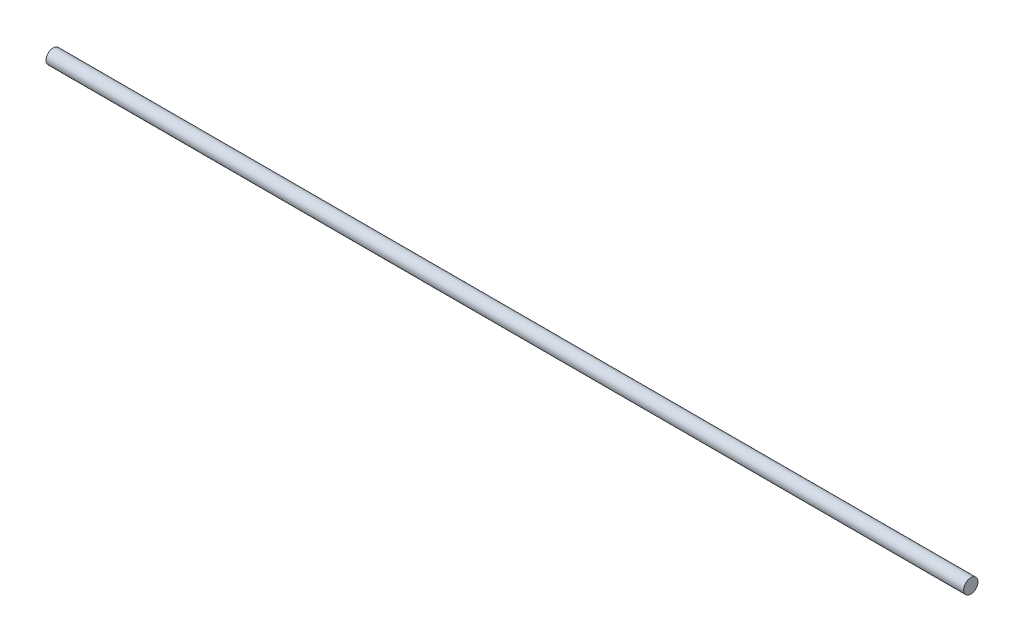
ISO-10303-21;
HEADER;
FILE_DESCRIPTION(('STEP AP214'),'2;1');
FILE_NAME('part.step','',(''),(''),'','','');
FILE_SCHEMA(('AUTOMOTIVE_DESIGN { 1 0 10303 214 1 1 1 1 }'));
ENDSEC;
DATA;
#1=APPLICATION_CONTEXT('core data for automotive mechanical design processes');
#2=APPLICATION_PROTOCOL_DEFINITION('international standard','automotive_design',2000,#1);
#3=PRODUCT_CONTEXT('',#1,'mechanical');
#4=PRODUCT('Part','Part','',(#3));
#5=PRODUCT_RELATED_PRODUCT_CATEGORY('part','',(#4));
#6=PRODUCT_DEFINITION_FORMATION('','',#4);
#7=PRODUCT_DEFINITION_CONTEXT('part definition',#1,'design');
#8=PRODUCT_DEFINITION('design','',#6,#7);
#9=PRODUCT_DEFINITION_SHAPE('','',#8);
#10=(LENGTH_UNIT() NAMED_UNIT(*) SI_UNIT(.MILLI.,.METRE.));
#11=(NAMED_UNIT(*) PLANE_ANGLE_UNIT() SI_UNIT($,.RADIAN.));
#12=(NAMED_UNIT(*) SI_UNIT($,.STERADIAN.) SOLID_ANGLE_UNIT());
#13=UNCERTAINTY_MEASURE_WITH_UNIT(LENGTH_MEASURE(1.E-05),#10,'distance_accuracy_value','');
#14=(GEOMETRIC_REPRESENTATION_CONTEXT(3) GLOBAL_UNCERTAINTY_ASSIGNED_CONTEXT((#13)) GLOBAL_UNIT_ASSIGNED_CONTEXT((#10,
#11,#12)) REPRESENTATION_CONTEXT('',''));
#15=CARTESIAN_POINT('',(0.,0.,0.));
#16=DIRECTION('',(0.,0.,1.));
#17=DIRECTION('',(1.,0.,0.));
#18=AXIS2_PLACEMENT_3D('',#15,#16,#17);
#19=CARTESIAN_POINT('',(609.6,0.,0.));
#20=DIRECTION('',(-1.,0.,0.));
#21=DIRECTION('',(0.,0.,1.));
#22=AXIS2_PLACEMENT_3D('',#19,#20,#21);
#23=CYLINDRICAL_SURFACE('',#22,4.7625);
#24=CARTESIAN_POINT('',(609.6,0.,0.));
#25=DIRECTION('',(1.,0.,0.));
#26=DIRECTION('',(0.,0.,-1.));
#27=AXIS2_PLACEMENT_3D('',#24,#25,#26);
#28=CIRCLE('',#27,4.7625);
#29=CARTESIAN_POINT('',(609.6,0.,-4.7625));
#30=VERTEX_POINT('',#29);
#31=EDGE_CURVE('E10',#30,#30,#28,.T.);
#32=ORIENTED_EDGE('',*,*,#31,.F.);
#33=EDGE_LOOP('',(#32));
#34=FACE_BOUND('',#33,.T.);
#35=CARTESIAN_POINT('',(0.,0.,0.));
#36=DIRECTION('',(1.,0.,0.));
#37=DIRECTION('',(0.,0.,-1.));
#38=AXIS2_PLACEMENT_3D('',#35,#36,#37);
#39=CIRCLE('',#38,4.7625);
#40=CARTESIAN_POINT('',(0.,0.,-4.7625));
#41=VERTEX_POINT('',#40);
#42=EDGE_CURVE('E35',#41,#41,#39,.T.);
#43=ORIENTED_EDGE('',*,*,#42,.T.);
#44=EDGE_LOOP('',(#43));
#45=FACE_BOUND('',#44,.T.);
#46=ADVANCED_FACE('F32',(#34,#45),#23,.T.);
#47=CARTESIAN_POINT('',(609.6,0.,0.));
#48=DIRECTION('',(1.,0.,0.));
#49=DIRECTION('',(0.,0.,-1.));
#50=AXIS2_PLACEMENT_3D('',#47,#48,#49);
#51=PLANE('',#50);
#52=ORIENTED_EDGE('',*,*,#31,.T.);
#53=EDGE_LOOP('',(#52));
#54=FACE_BOUND('',#53,.T.);
#55=ADVANCED_FACE('F47',(#54),#51,.T.);
#56=CARTESIAN_POINT('',(0.,0.,0.));
#57=DIRECTION('',(1.,0.,0.));
#58=DIRECTION('',(0.,0.,-1.));
#59=AXIS2_PLACEMENT_3D('',#56,#57,#58);
#60=PLANE('',#59);
#61=ORIENTED_EDGE('',*,*,#42,.F.);
#62=EDGE_LOOP('',(#61));
#63=FACE_BOUND('',#62,.T.);
#64=ADVANCED_FACE('F45',(#63),#60,.F.);
#65=CLOSED_SHELL('',(#46,#55,#64));
#66=MANIFOLD_SOLID_BREP('B2',#65);
#67=ADVANCED_BREP_SHAPE_REPRESENTATION('',(#18,#66),#14);
#68=SHAPE_DEFINITION_REPRESENTATION(#9,#67);
ENDSEC;
END-ISO-10303-21;
